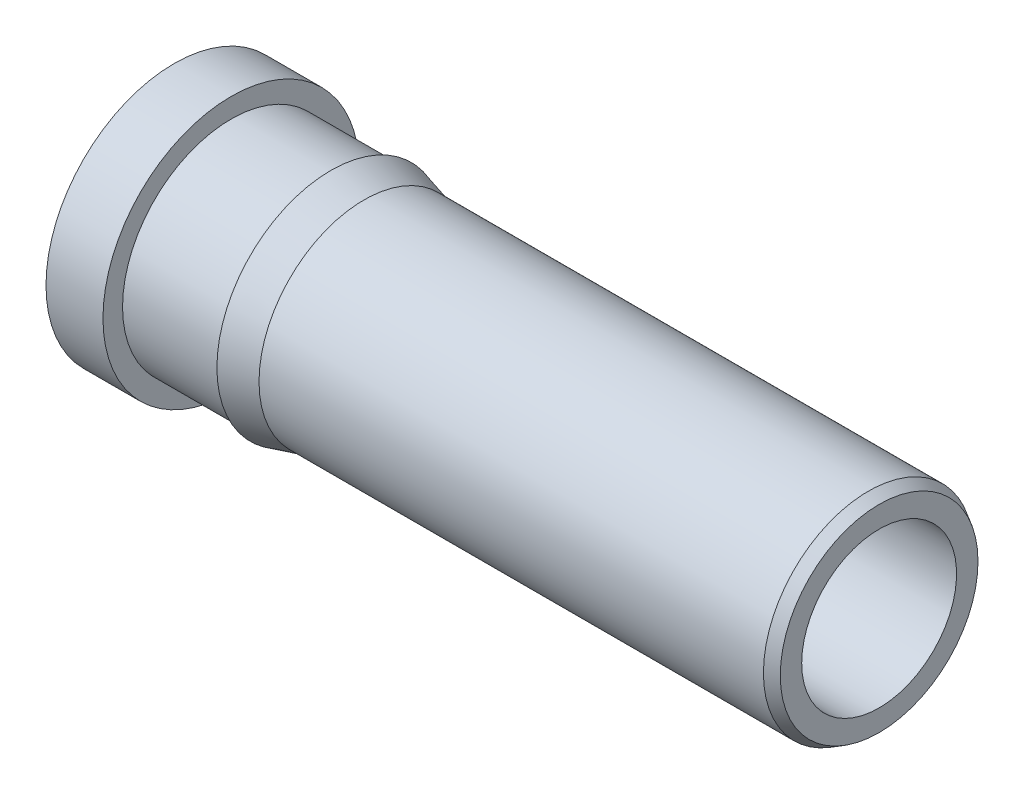
ISO-10303-21;
HEADER;
FILE_DESCRIPTION(('STEP AP214'),'2;1');
FILE_NAME('part.step','',(''),(''),'','','');
FILE_SCHEMA(('AUTOMOTIVE_DESIGN { 1 0 10303 214 1 1 1 1 }'));
ENDSEC;
DATA;
#1=APPLICATION_CONTEXT('core data for automotive mechanical design processes');
#2=APPLICATION_PROTOCOL_DEFINITION('international standard','automotive_design',2000,#1);
#3=PRODUCT_CONTEXT('',#1,'mechanical');
#4=PRODUCT('Part','Part','',(#3));
#5=PRODUCT_RELATED_PRODUCT_CATEGORY('part','',(#4));
#6=PRODUCT_DEFINITION_FORMATION('','',#4);
#7=PRODUCT_DEFINITION_CONTEXT('part definition',#1,'design');
#8=PRODUCT_DEFINITION('design','',#6,#7);
#9=PRODUCT_DEFINITION_SHAPE('','',#8);
#10=(LENGTH_UNIT() NAMED_UNIT(*) SI_UNIT(.MILLI.,.METRE.));
#11=(NAMED_UNIT(*) PLANE_ANGLE_UNIT() SI_UNIT($,.RADIAN.));
#12=(NAMED_UNIT(*) SI_UNIT($,.STERADIAN.) SOLID_ANGLE_UNIT());
#13=UNCERTAINTY_MEASURE_WITH_UNIT(LENGTH_MEASURE(1.E-05),#10,'distance_accuracy_value','');
#14=(GEOMETRIC_REPRESENTATION_CONTEXT(3) GLOBAL_UNCERTAINTY_ASSIGNED_CONTEXT((#13)) GLOBAL_UNIT_ASSIGNED_CONTEXT((#10,
#11,#12)) REPRESENTATION_CONTEXT('',''));
#15=CARTESIAN_POINT('',(0.,0.,0.));
#16=DIRECTION('',(0.,0.,1.));
#17=DIRECTION('',(1.,0.,0.));
#18=AXIS2_PLACEMENT_3D('',#15,#16,#17);
#19=CARTESIAN_POINT('',(0.,0.,0.));
#20=DIRECTION('',(-1.,0.,0.));
#21=DIRECTION('',(0.,0.,1.));
#22=AXIS2_PLACEMENT_3D('',#19,#20,#21);
#23=CYLINDRICAL_SURFACE('',#22,0.55245);
#24=CARTESIAN_POINT('',(2.394031973962,0.,0.));
#25=DIRECTION('',(1.,0.,0.));
#26=DIRECTION('',(0.,0.,1.));
#27=AXIS2_PLACEMENT_3D('',#24,#25,#26);
#28=CIRCLE('',#27,0.55245);
#29=CARTESIAN_POINT('',(2.394031973962,0.,0.55245));
#30=VERTEX_POINT('',#29);
#31=EDGE_CURVE('E23',#30,#30,#28,.T.);
#32=ORIENTED_EDGE('',*,*,#31,.F.);
#33=EDGE_LOOP('',(#32));
#34=FACE_BOUND('',#33,.T.);
#35=CARTESIAN_POINT('',(5.0292,0.,0.));
#36=DIRECTION('',(-1.,0.,0.));
#37=DIRECTION('',(0.,0.,1.));
#38=AXIS2_PLACEMENT_3D('',#35,#36,#37);
#39=CIRCLE('',#38,0.55245);
#40=CARTESIAN_POINT('',(5.0292,0.,0.55245));
#41=VERTEX_POINT('',#40);
#42=EDGE_CURVE('E50',#41,#41,#39,.T.);
#43=ORIENTED_EDGE('',*,*,#42,.F.);
#44=EDGE_LOOP('',(#43));
#45=FACE_BOUND('',#44,.T.);
#46=ADVANCED_FACE('F15',(#34,#45),#23,.F.);
#47=CARTESIAN_POINT('',(0.,0.,0.));
#48=DIRECTION('',(-1.,0.,0.));
#49=DIRECTION('',(0.,0.,1.));
#50=AXIS2_PLACEMENT_3D('',#47,#48,#49);
#51=CYLINDRICAL_SURFACE('',#50,0.6477);
#52=CARTESIAN_POINT('',(0.,0.,0.));
#53=DIRECTION('',(-1.,0.,0.));
#54=DIRECTION('',(0.,0.,1.));
#55=AXIS2_PLACEMENT_3D('',#52,#53,#54);
#56=CIRCLE('',#55,0.6477);
#57=CARTESIAN_POINT('',(0.,0.,0.6477));
#58=VERTEX_POINT('',#57);
#59=EDGE_CURVE('E10',#58,#58,#56,.T.);
#60=ORIENTED_EDGE('',*,*,#59,.T.);
#61=EDGE_LOOP('',(#60));
#62=FACE_BOUND('',#61,.T.);
#63=CARTESIAN_POINT('',(2.3368,0.,0.));
#64=DIRECTION('',(-1.,0.,0.));
#65=DIRECTION('',(0.,0.,1.));
#66=AXIS2_PLACEMENT_3D('',#63,#64,#65);
#67=CIRCLE('',#66,0.6477);
#68=CARTESIAN_POINT('',(2.3368,0.,0.6477));
#69=VERTEX_POINT('',#68);
#70=EDGE_CURVE('E28',#69,#69,#67,.T.);
#71=ORIENTED_EDGE('',*,*,#70,.F.);
#72=EDGE_LOOP('',(#71));
#73=FACE_BOUND('',#72,.T.);
#74=ADVANCED_FACE('F65',(#62,#73),#51,.F.);
#75=CARTESIAN_POINT('',(2.3368,0.,0.));
#76=DIRECTION('',(-1.,0.,0.));
#77=DIRECTION('',(0.,0.,1.));
#78=AXIS2_PLACEMENT_3D('',#75,#76,#77);
#79=CONICAL_SURFACE('',#78,0.6477,1.029744258677);
#80=ORIENTED_EDGE('',*,*,#70,.T.);
#81=EDGE_LOOP('',(#80));
#82=FACE_BOUND('',#81,.T.);
#83=ORIENTED_EDGE('',*,*,#31,.T.);
#84=EDGE_LOOP('',(#83));
#85=FACE_BOUND('',#84,.T.);
#86=ADVANCED_FACE('F72',(#82,#85),#79,.F.);
#87=CARTESIAN_POINT('',(0.,0.,0.));
#88=DIRECTION('',(-1.,0.,0.));
#89=DIRECTION('',(0.,0.,1.));
#90=AXIS2_PLACEMENT_3D('',#87,#88,#89);
#91=CYLINDRICAL_SURFACE('',#90,0.9144);
#92=CARTESIAN_POINT('',(0.,0.,0.));
#93=DIRECTION('',(-1.,0.,0.));
#94=DIRECTION('',(0.,0.,1.));
#95=AXIS2_PLACEMENT_3D('',#92,#93,#94);
#96=CIRCLE('',#95,0.9144);
#97=CARTESIAN_POINT('',(0.,0.,0.9144));
#98=VERTEX_POINT('',#97);
#99=EDGE_CURVE('E36',#98,#98,#96,.T.);
#100=ORIENTED_EDGE('',*,*,#99,.F.);
#101=EDGE_LOOP('',(#100));
#102=FACE_BOUND('',#101,.T.);
#103=CARTESIAN_POINT('',(0.4064,0.,0.));
#104=DIRECTION('',(-1.,0.,0.));
#105=DIRECTION('',(0.,0.,1.));
#106=AXIS2_PLACEMENT_3D('',#103,#104,#105);
#107=CIRCLE('',#106,0.9144);
#108=CARTESIAN_POINT('',(0.4064,0.,0.9144));
#109=VERTEX_POINT('',#108);
#110=EDGE_CURVE('E32',#109,#109,#107,.T.);
#111=ORIENTED_EDGE('',*,*,#110,.T.);
#112=EDGE_LOOP('',(#111));
#113=FACE_BOUND('',#112,.T.);
#114=ADVANCED_FACE('F78',(#102,#113),#91,.T.);
#115=CARTESIAN_POINT('',(0.,0.,0.));
#116=DIRECTION('',(-1.,0.,0.));
#117=DIRECTION('',(0.,0.,1.));
#118=AXIS2_PLACEMENT_3D('',#115,#116,#117);
#119=CYLINDRICAL_SURFACE('',#118,0.7747);
#120=CARTESIAN_POINT('',(0.4064,0.,0.));
#121=DIRECTION('',(-1.,0.,0.));
#122=DIRECTION('',(0.,0.,1.));
#123=AXIS2_PLACEMENT_3D('',#120,#121,#122);
#124=CIRCLE('',#123,0.7747);
#125=CARTESIAN_POINT('',(0.4064,0.,0.7747));
#126=VERTEX_POINT('',#125);
#127=EDGE_CURVE('E39',#126,#126,#124,.T.);
#128=ORIENTED_EDGE('',*,*,#127,.F.);
#129=EDGE_LOOP('',(#128));
#130=FACE_BOUND('',#129,.T.);
#131=CARTESIAN_POINT('',(1.1176,0.,0.));
#132=DIRECTION('',(-1.,0.,0.));
#133=DIRECTION('',(0.,0.,1.));
#134=AXIS2_PLACEMENT_3D('',#131,#132,#133);
#135=CIRCLE('',#134,0.7747);
#136=CARTESIAN_POINT('',(1.1176,0.,0.7747));
#137=VERTEX_POINT('',#136);
#138=EDGE_CURVE('E35',#137,#137,#135,.T.);
#139=ORIENTED_EDGE('',*,*,#138,.T.);
#140=EDGE_LOOP('',(#139));
#141=FACE_BOUND('',#140,.T.);
#142=ADVANCED_FACE('F82',(#130,#141),#119,.T.);
#143=CARTESIAN_POINT('',(1.354585226281,0.,0.));
#144=DIRECTION('',(-1.,0.,0.));
#145=DIRECTION('',(0.,0.,1.));
#146=AXIS2_PLACEMENT_3D('',#143,#144,#145);
#147=CONICAL_SURFACE('',#146,0.7493,0.261799387799);
#148=CARTESIAN_POINT('',(1.1176,0.,0.));
#149=DIRECTION('',(-1.,0.,0.));
#150=DIRECTION('',(0.,0.,1.));
#151=AXIS2_PLACEMENT_3D('',#148,#149,#150);
#152=CIRCLE('',#151,0.8128);
#153=CARTESIAN_POINT('',(1.1176,0.,0.8128));
#154=VERTEX_POINT('',#153);
#155=EDGE_CURVE('E45',#154,#154,#152,.T.);
#156=ORIENTED_EDGE('',*,*,#155,.F.);
#157=EDGE_LOOP('',(#156));
#158=FACE_BOUND('',#157,.T.);
#159=CARTESIAN_POINT('',(1.354585226281,0.,0.));
#160=DIRECTION('',(-1.,0.,0.));
#161=DIRECTION('',(0.,0.,1.));
#162=AXIS2_PLACEMENT_3D('',#159,#160,#161);
#163=CIRCLE('',#162,0.7493);
#164=CARTESIAN_POINT('',(1.354585226281,0.,0.7493));
#165=VERTEX_POINT('',#164);
#166=EDGE_CURVE('E42',#165,#165,#163,.T.);
#167=ORIENTED_EDGE('',*,*,#166,.T.);
#168=EDGE_LOOP('',(#167));
#169=FACE_BOUND('',#168,.T.);
#170=ADVANCED_FACE('F86',(#158,#169),#147,.T.);
#171=CARTESIAN_POINT('',(0.,0.,0.));
#172=DIRECTION('',(-1.,0.,0.));
#173=DIRECTION('',(0.,0.,1.));
#174=AXIS2_PLACEMENT_3D('',#171,#172,#173);
#175=CYLINDRICAL_SURFACE('',#174,0.7493);
#176=ORIENTED_EDGE('',*,*,#166,.F.);
#177=EDGE_LOOP('',(#176));
#178=FACE_BOUND('',#177,.T.);
#179=CARTESIAN_POINT('',(4.953,0.,0.));
#180=DIRECTION('',(-1.,0.,0.));
#181=DIRECTION('',(0.,0.,1.));
#182=AXIS2_PLACEMENT_3D('',#179,#180,#181);
#183=CIRCLE('',#182,0.7493);
#184=CARTESIAN_POINT('',(4.953,0.,0.7493));
#185=VERTEX_POINT('',#184);
#186=EDGE_CURVE('E48',#185,#185,#183,.T.);
#187=ORIENTED_EDGE('',*,*,#186,.T.);
#188=EDGE_LOOP('',(#187));
#189=FACE_BOUND('',#188,.T.);
#190=ADVANCED_FACE('F90',(#178,#189),#175,.T.);
#191=CARTESIAN_POINT('',(5.0292,0.,0.));
#192=DIRECTION('',(-1.,0.,0.));
#193=DIRECTION('',(0.,0.,1.));
#194=AXIS2_PLACEMENT_3D('',#191,#192,#193);
#195=CONICAL_SURFACE('',#194,0.705305909488,0.523598775599);
#196=ORIENTED_EDGE('',*,*,#186,.F.);
#197=EDGE_LOOP('',(#196));
#198=FACE_BOUND('',#197,.T.);
#199=CARTESIAN_POINT('',(5.0292,0.,0.));
#200=DIRECTION('',(-1.,0.,0.));
#201=DIRECTION('',(0.,0.,1.));
#202=AXIS2_PLACEMENT_3D('',#199,#200,#201);
#203=CIRCLE('',#202,0.705305909488);
#204=CARTESIAN_POINT('',(5.0292,0.,0.705305909488));
#205=VERTEX_POINT('',#204);
#206=EDGE_CURVE('E19',#205,#205,#203,.T.);
#207=ORIENTED_EDGE('',*,*,#206,.T.);
#208=EDGE_LOOP('',(#207));
#209=FACE_BOUND('',#208,.T.);
#210=ADVANCED_FACE('F94',(#198,#209),#195,.T.);
#211=CARTESIAN_POINT('',(5.0292,0.705305909488,0.));
#212=DIRECTION('',(-1.,0.,0.));
#213=DIRECTION('',(0.,0.,1.));
#214=AXIS2_PLACEMENT_3D('',#211,#212,#213);
#215=PLANE('',#214);
#216=ORIENTED_EDGE('',*,*,#42,.T.);
#217=EDGE_LOOP('',(#216));
#218=FACE_BOUND('',#217,.T.);
#219=ORIENTED_EDGE('',*,*,#206,.F.);
#220=EDGE_LOOP('',(#219));
#221=FACE_BOUND('',#220,.T.);
#222=ADVANCED_FACE('F61',(#218,#221),#215,.F.);
#223=CARTESIAN_POINT('',(1.1176,0.7747,0.));
#224=DIRECTION('',(1.,0.,0.));
#225=DIRECTION('',(0.,0.,-1.));
#226=AXIS2_PLACEMENT_3D('',#223,#224,#225);
#227=PLANE('',#226);
#228=ORIENTED_EDGE('',*,*,#138,.F.);
#229=EDGE_LOOP('',(#228));
#230=FACE_BOUND('',#229,.T.);
#231=ORIENTED_EDGE('',*,*,#155,.T.);
#232=EDGE_LOOP('',(#231));
#233=FACE_BOUND('',#232,.T.);
#234=ADVANCED_FACE('F101',(#230,#233),#227,.F.);
#235=CARTESIAN_POINT('',(0.4064,0.9144,0.));
#236=DIRECTION('',(-1.,0.,0.));
#237=DIRECTION('',(0.,0.,1.));
#238=AXIS2_PLACEMENT_3D('',#235,#236,#237);
#239=PLANE('',#238);
#240=ORIENTED_EDGE('',*,*,#110,.F.);
#241=EDGE_LOOP('',(#240));
#242=FACE_BOUND('',#241,.T.);
#243=ORIENTED_EDGE('',*,*,#127,.T.);
#244=EDGE_LOOP('',(#243));
#245=FACE_BOUND('',#244,.T.);
#246=ADVANCED_FACE('F103',(#242,#245),#239,.F.);
#247=CARTESIAN_POINT('',(0.,0.,0.));
#248=DIRECTION('',(1.,0.,0.));
#249=DIRECTION('',(0.,0.,-1.));
#250=AXIS2_PLACEMENT_3D('',#247,#248,#249);
#251=PLANE('',#250);
#252=ORIENTED_EDGE('',*,*,#59,.F.);
#253=EDGE_LOOP('',(#252));
#254=FACE_BOUND('',#253,.T.);
#255=ORIENTED_EDGE('',*,*,#99,.T.);
#256=EDGE_LOOP('',(#255));
#257=FACE_BOUND('',#256,.T.);
#258=ADVANCED_FACE('F17',(#254,#257),#251,.F.);
#259=CLOSED_SHELL('',(#46,#74,#86,#114,#142,#170,#190,#210,#222,#234,#246,#258));
#260=MANIFOLD_SOLID_BREP('B1',#259);
#261=ADVANCED_BREP_SHAPE_REPRESENTATION('',(#18,#260),#14);
#262=SHAPE_DEFINITION_REPRESENTATION(#9,#261);
ENDSEC;
END-ISO-10303-21;
